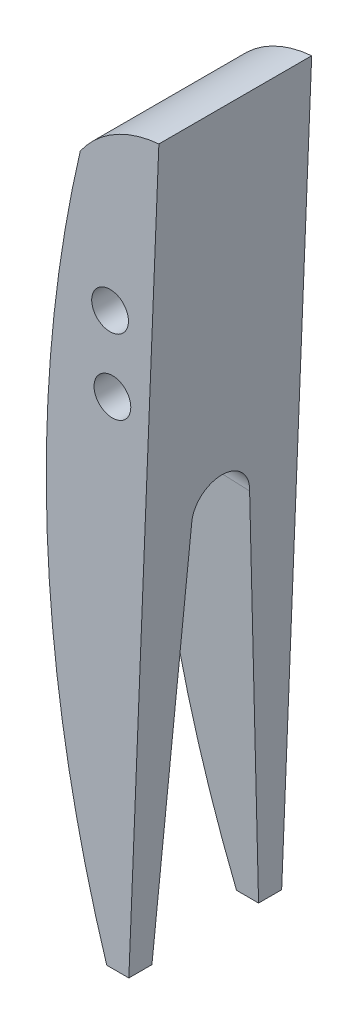
ISO-10303-21;
HEADER;
FILE_DESCRIPTION(('STEP AP214'),'2;1');
FILE_NAME('part.step','',(''),(''),'','','');
FILE_SCHEMA(('AUTOMOTIVE_DESIGN { 1 0 10303 214 1 1 1 1 }'));
ENDSEC;
DATA;
#1=APPLICATION_CONTEXT('core data for automotive mechanical design processes');
#2=APPLICATION_PROTOCOL_DEFINITION('international standard','automotive_design',2000,#1);
#3=PRODUCT_CONTEXT('',#1,'mechanical');
#4=PRODUCT('Part','Part','',(#3));
#5=PRODUCT_RELATED_PRODUCT_CATEGORY('part','',(#4));
#6=PRODUCT_DEFINITION_FORMATION('','',#4);
#7=PRODUCT_DEFINITION_CONTEXT('part definition',#1,'design');
#8=PRODUCT_DEFINITION('design','',#6,#7);
#9=PRODUCT_DEFINITION_SHAPE('','',#8);
#10=(LENGTH_UNIT() NAMED_UNIT(*) SI_UNIT(.MILLI.,.METRE.));
#11=(NAMED_UNIT(*) PLANE_ANGLE_UNIT() SI_UNIT($,.RADIAN.));
#12=(NAMED_UNIT(*) SI_UNIT($,.STERADIAN.) SOLID_ANGLE_UNIT());
#13=UNCERTAINTY_MEASURE_WITH_UNIT(LENGTH_MEASURE(1.E-05),#10,'distance_accuracy_value','');
#14=(GEOMETRIC_REPRESENTATION_CONTEXT(3) GLOBAL_UNCERTAINTY_ASSIGNED_CONTEXT((#13)) GLOBAL_UNIT_ASSIGNED_CONTEXT((#10,
#11,#12)) REPRESENTATION_CONTEXT('',''));
#15=CARTESIAN_POINT('',(0.,0.,0.));
#16=DIRECTION('',(0.,0.,1.));
#17=DIRECTION('',(1.,0.,0.));
#18=AXIS2_PLACEMENT_3D('',#15,#16,#17);
#19=CARTESIAN_POINT('',(74.7353828290248,81.7864220973109,10.033));
#20=DIRECTION('',(0.,0.,1.));
#21=DIRECTION('',(1.,0.,0.));
#22=AXIS2_PLACEMENT_3D('',#19,#20,#21);
#23=PLANE('',#22);
#24=DIRECTION('',(-1.,0.,0.));
#25=VECTOR('',#24,1.);
#26=CARTESIAN_POINT('',(70.7043807606594,40.3898056532261,10.033));
#27=LINE('',#26,#25);
#28=CARTESIAN_POINT('',(72.15587101361,40.3898056532261,10.033));
#29=VERTEX_POINT('',#28);
#30=CARTESIAN_POINT('',(70.7043807606594,40.3898056532261,10.033));
#31=VERTEX_POINT('',#30);
#32=EDGE_CURVE('E100',#29,#31,#27,.T.);
#33=ORIENTED_EDGE('',*,*,#32,.F.);
#34=DIRECTION('',(0.040704362984607,0.999171233990459,0.));
#35=VECTOR('',#34,1.);
#36=CARTESIAN_POINT('',(74.1278462983194,88.7959428372659,10.033));
#37=LINE('',#36,#35);
#38=CARTESIAN_POINT('',(74.1278462983194,88.7959428372659,10.033));
#39=VERTEX_POINT('',#38);
#40=EDGE_CURVE('E111',#29,#39,#37,.T.);
#41=ORIENTED_EDGE('',*,*,#40,.T.);
#42=CARTESIAN_POINT('',(74.7353828290248,81.7864220973109,10.033));
#43=DIRECTION('',(0.,0.,1.));
#44=DIRECTION('',(1.,0.,0.));
#45=AXIS2_PLACEMENT_3D('',#42,#43,#44);
#46=CIRCLE('',#45,7.03580000000001);
#47=CARTESIAN_POINT('',(68.9663347270801,85.8138984333617,10.033));
#48=VERTEX_POINT('',#47);
#49=EDGE_CURVE('E121',#39,#48,#46,.T.);
#50=ORIENTED_EDGE('',*,*,#49,.T.);
#51=CARTESIAN_POINT('',(153.221382829025,66.292422097311,10.033));
#52=DIRECTION('',(0.,0.,1.));
#53=DIRECTION('',(1.,0.,0.));
#54=AXIS2_PLACEMENT_3D('',#51,#52,#53);
#55=CIRCLE('',#54,86.487);
#56=EDGE_CURVE('E113',#48,#31,#55,.T.);
#57=ORIENTED_EDGE('',*,*,#56,.T.);
#58=EDGE_LOOP('',(#33,#41,#50,#57));
#59=FACE_BOUND('',#58,.T.);
#60=CARTESIAN_POINT('',(70.9253828290248,77.722422097311,10.033));
#61=DIRECTION('',(0.,0.,1.));
#62=DIRECTION('',(1.,0.,0.));
#63=AXIS2_PLACEMENT_3D('',#60,#61,#62);
#64=CIRCLE('',#63,1.2065);
#65=CARTESIAN_POINT('',(72.1318828290248,77.722422097311,10.033));
#66=VERTEX_POINT('',#65);
#67=EDGE_CURVE('E129',#66,#66,#64,.T.);
#68=ORIENTED_EDGE('',*,*,#67,.F.);
#69=EDGE_LOOP('',(#68));
#70=FACE_BOUND('',#69,.T.);
#71=CARTESIAN_POINT('',(71.0777828290248,72.896422097311,10.033));
#72=DIRECTION('',(0.,0.,1.));
#73=DIRECTION('',(1.,0.,0.));
#74=AXIS2_PLACEMENT_3D('',#71,#72,#73);
#75=CIRCLE('',#74,1.2065);
#76=CARTESIAN_POINT('',(72.2842828290248,72.896422097311,10.033));
#77=VERTEX_POINT('',#76);
#78=EDGE_CURVE('E289',#77,#77,#75,.T.);
#79=ORIENTED_EDGE('',*,*,#78,.F.);
#80=EDGE_LOOP('',(#79));
#81=FACE_BOUND('',#80,.T.);
#82=ADVANCED_FACE('F35',(#59,#70,#81),#23,.T.);
#83=CARTESIAN_POINT('',(74.7353828290248,81.7864220973109,0.));
#84=DIRECTION('',(0.,0.,1.));
#85=DIRECTION('',(1.,0.,0.));
#86=AXIS2_PLACEMENT_3D('',#83,#84,#85);
#87=PLANE('',#86);
#88=DIRECTION('',(0.040704362984607,0.999171233990459,0.));
#89=VECTOR('',#88,1.);
#90=CARTESIAN_POINT('',(74.1278462983194,88.7959428372659,0.));
#91=LINE('',#90,#89);
#92=CARTESIAN_POINT('',(72.15587101361,40.3898056532261,0.));
#93=VERTEX_POINT('',#92);
#94=CARTESIAN_POINT('',(74.1278462983194,88.7959428372659,0.));
#95=VERTEX_POINT('',#94);
#96=EDGE_CURVE('E132',#93,#95,#91,.T.);
#97=ORIENTED_EDGE('',*,*,#96,.F.);
#98=DIRECTION('',(1.,0.,0.));
#99=VECTOR('',#98,1.);
#100=CARTESIAN_POINT('',(70.7043807606594,40.3898056532261,0.));
#101=LINE('',#100,#99);
#102=CARTESIAN_POINT('',(70.7043807606594,40.3898056532261,0.));
#103=VERTEX_POINT('',#102);
#104=EDGE_CURVE('E145',#103,#93,#101,.T.);
#105=ORIENTED_EDGE('',*,*,#104,.F.);
#106=CARTESIAN_POINT('',(153.221382829025,66.292422097311,0.));
#107=DIRECTION('',(0.,0.,1.));
#108=DIRECTION('',(1.,0.,0.));
#109=AXIS2_PLACEMENT_3D('',#106,#107,#108);
#110=CIRCLE('',#109,86.487);
#111=CARTESIAN_POINT('',(68.9663347270801,85.8138984333617,0.));
#112=VERTEX_POINT('',#111);
#113=EDGE_CURVE('E128',#112,#103,#110,.T.);
#114=ORIENTED_EDGE('',*,*,#113,.F.);
#115=CARTESIAN_POINT('',(74.7353828290248,81.7864220973109,0.));
#116=DIRECTION('',(0.,0.,1.));
#117=DIRECTION('',(1.,0.,0.));
#118=AXIS2_PLACEMENT_3D('',#115,#116,#117);
#119=CIRCLE('',#118,7.03580000000001);
#120=EDGE_CURVE('E125',#95,#112,#119,.T.);
#121=ORIENTED_EDGE('',*,*,#120,.F.);
#122=EDGE_LOOP('',(#97,#105,#114,#121));
#123=FACE_BOUND('',#122,.T.);
#124=CARTESIAN_POINT('',(70.9253828290248,77.722422097311,0.));
#125=DIRECTION('',(0.,0.,1.));
#126=DIRECTION('',(1.,0.,0.));
#127=AXIS2_PLACEMENT_3D('',#124,#125,#126);
#128=CIRCLE('',#127,1.2065);
#129=CARTESIAN_POINT('',(72.1318828290248,77.722422097311,0.));
#130=VERTEX_POINT('',#129);
#131=EDGE_CURVE('E294',#130,#130,#128,.T.);
#132=ORIENTED_EDGE('',*,*,#131,.T.);
#133=EDGE_LOOP('',(#132));
#134=FACE_BOUND('',#133,.T.);
#135=CARTESIAN_POINT('',(71.0777828290248,72.896422097311,0.));
#136=DIRECTION('',(0.,0.,1.));
#137=DIRECTION('',(1.,0.,0.));
#138=AXIS2_PLACEMENT_3D('',#135,#136,#137);
#139=CIRCLE('',#138,1.2065);
#140=CARTESIAN_POINT('',(72.2842828290248,72.896422097311,0.));
#141=VERTEX_POINT('',#140);
#142=EDGE_CURVE('E287',#141,#141,#139,.T.);
#143=ORIENTED_EDGE('',*,*,#142,.T.);
#144=EDGE_LOOP('',(#143));
#145=FACE_BOUND('',#144,.T.);
#146=ADVANCED_FACE('F142',(#123,#134,#145),#87,.F.);
#147=CARTESIAN_POINT('',(74.7353828290248,81.7864220973109,10.033));
#148=DIRECTION('',(0.,0.,-1.));
#149=DIRECTION('',(-1.,0.,0.));
#150=AXIS2_PLACEMENT_3D('',#147,#148,#149);
#151=CYLINDRICAL_SURFACE('',#150,7.03580000000001);
#152=ORIENTED_EDGE('',*,*,#120,.T.);
#153=DIRECTION('',(0.,0.,-1.));
#154=VECTOR('',#153,1.);
#155=CARTESIAN_POINT('',(68.9663347270801,85.8138984333617,10.033));
#156=LINE('',#155,#154);
#157=EDGE_CURVE('E43',#48,#112,#156,.T.);
#158=ORIENTED_EDGE('',*,*,#157,.F.);
#159=ORIENTED_EDGE('',*,*,#49,.F.);
#160=DIRECTION('',(0.,0.,-1.));
#161=VECTOR('',#160,1.);
#162=CARTESIAN_POINT('',(74.1278462983194,88.7959428372659,10.033));
#163=LINE('',#162,#161);
#164=EDGE_CURVE('E117',#39,#95,#163,.T.);
#165=ORIENTED_EDGE('',*,*,#164,.T.);
#166=EDGE_LOOP('',(#152,#158,#159,#165));
#167=FACE_BOUND('',#166,.T.);
#168=ADVANCED_FACE('F37',(#167),#151,.T.);
#169=CARTESIAN_POINT('',(153.221382829025,66.292422097311,10.033));
#170=DIRECTION('',(0.,0.,-1.));
#171=DIRECTION('',(-1.,0.,0.));
#172=AXIS2_PLACEMENT_3D('',#169,#170,#171);
#173=CYLINDRICAL_SURFACE('',#172,86.487);
#174=ORIENTED_EDGE('',*,*,#113,.T.);
#175=DIRECTION('',(0.,0.,1.));
#176=VECTOR('',#175,1.);
#177=CARTESIAN_POINT('',(70.7043807606594,40.3898056532261,-4.08215330838494));
#178=LINE('',#177,#176);
#179=CARTESIAN_POINT('',(70.7043807606594,40.3898056532261,1.51227671406782));
#180=VERTEX_POINT('',#179);
#181=EDGE_CURVE('E146',#103,#180,#178,.T.);
#182=ORIENTED_EDGE('',*,*,#181,.T.);
#183=CARTESIAN_POINT('',(153.221382829025,66.292422097311,3.39662912735156));
#184=DIRECTION('',(0.0026177398413144,0.0642577393607959,-0.997929902533421));
#185=DIRECTION('',(-0.0406201009859138,-0.997102852150297,-0.0643110381632639));
#186=AXIS2_PLACEMENT_3D('',#183,#184,#185);
#187=ELLIPSE('',#186,86.666407911455,86.487);
#188=CARTESIAN_POINT('',(66.7391175209196,65.3874601210305,3.11149999999997));
#189=VERTEX_POINT('',#188);
#190=EDGE_CURVE('E161',#180,#189,#187,.T.);
#191=ORIENTED_EDGE('',*,*,#190,.T.);
#192=CARTESIAN_POINT('',(66.7391175209196,65.3874601210305,3.11149999999997));
#193=CARTESIAN_POINT('',(66.7385556558944,65.4411278103967,3.11150038620164));
#194=CARTESIAN_POINT('',(66.7380446370746,65.4947704289813,3.11376362614224));
#195=CARTESIAN_POINT('',(66.7371248030678,65.6016737523277,3.1227941187202));
#196=CARTESIAN_POINT('',(66.7367159836392,65.6549344728505,3.12956118438911));
#197=CARTESIAN_POINT('',(66.7356446393563,65.8134883275784,3.15655784723912));
#198=CARTESIAN_POINT('',(66.7351354785727,65.9177221058591,3.18348306749004));
#199=CARTESIAN_POINT('',(66.7344948661265,66.1201889091231,3.25445349755626));
#200=CARTESIAN_POINT('',(66.7343636015566,66.2184189381641,3.29850717525166));
#201=CARTESIAN_POINT('',(66.7344066006435,66.4060749597693,3.40248606617196));
#202=CARTESIAN_POINT('',(66.7345807992412,66.4955028227813,3.46240789740546));
#203=CARTESIAN_POINT('',(66.7351359263829,66.6629431487419,3.59637466553797));
#204=CARTESIAN_POINT('',(66.7355166883609,66.740964745073,3.67040819206251));
#205=CARTESIAN_POINT('',(66.7363730389729,66.883473488676,3.83054302090883));
#206=CARTESIAN_POINT('',(66.7368486420575,66.9479585703625,3.91664616163807));
#207=CARTESIAN_POINT('',(66.7377836672712,67.0614984985323,4.098396039838));
#208=CARTESIAN_POINT('',(66.7382431013325,67.1105649447823,4.19403553120485));
#209=CARTESIAN_POINT('',(66.7390510654862,67.1919369090083,4.39219031680982));
#210=CARTESIAN_POINT('',(66.7393996029632,67.2242435430946,4.4947051526747));
#211=CARTESIAN_POINT('',(66.7399179654658,67.2711767285449,4.7036774655834));
#212=CARTESIAN_POINT('',(66.7400878368037,67.2858078617375,4.81013391350823));
#213=CARTESIAN_POINT('',(66.7402169909001,67.2969901683433,5.02399477562736));
#214=CARTESIAN_POINT('',(66.7401762689048,67.2935409336301,5.13139921116586));
#215=CARTESIAN_POINT('',(66.7398918657832,67.2686604474035,5.34409578121339));
#216=CARTESIAN_POINT('',(66.7396482006591,67.2472306136678,5.4493880815949));
#217=CARTESIAN_POINT('',(66.739004275444,67.1869992077408,5.65487995867905));
#218=CARTESIAN_POINT('',(66.7386040159197,67.1481976983944,5.7550795538039));
#219=CARTESIAN_POINT('',(66.7377261678881,67.0543224012855,5.94754784231817));
#220=CARTESIAN_POINT('',(66.7372485753036,66.9992477554156,6.03981611714553));
#221=CARTESIAN_POINT('',(66.736318447865,66.8743941841238,6.21379405832366));
#222=CARTESIAN_POINT('',(66.7358659117865,66.8046159780215,6.29550424087616));
#223=CARTESIAN_POINT('',(66.7350982703756,66.6523349676086,6.44605914072651));
#224=CARTESIAN_POINT('',(66.7347831707158,66.5698316382595,6.51490332691398));
#225=CARTESIAN_POINT('',(66.7343985728257,66.3944117668896,6.63779500259123));
#226=CARTESIAN_POINT('',(66.7343291524078,66.3014919353223,6.69183779912371));
#227=CARTESIAN_POINT('',(66.7345255733129,66.1078165454996,6.78362466673437));
#228=CARTESIAN_POINT('',(66.7347917914747,66.0070522991687,6.82135035383468));
#229=CARTESIAN_POINT('',(66.7357194120165,65.8007043529685,6.87931447201896));
#230=CARTESIAN_POINT('',(66.7363802153059,65.6951281829413,6.89957929985357));
#231=CARTESIAN_POINT('',(66.7375176581982,65.5552861432379,6.91441047662789));
#232=CARTESIAN_POINT('',(66.7378100459612,65.5217461293835,6.91707054661055));
#233=CARTESIAN_POINT('',(66.7384342794623,65.4546285715774,6.9206128792976));
#234=CARTESIAN_POINT('',(66.7387660588078,65.4210511826678,6.92149808962336));
#235=CARTESIAN_POINT('',(66.7391175209196,65.3874601210305,6.92149999999997));
#236=B_SPLINE_CURVE_WITH_KNOTS('',3,(#192,#193,#194,#195,#196,#197,#198,#199,#200,#201,#202,
#203,#204,#205,#206,#207,#208,#209,#210,#211,#212,#213,#214,#215,#216,#217,#218,#219,#220,#221,
#222,#223,#224,#225,#226,#227,#228,#229,#230,#231,#232,#233,#234,#235),.UNSPECIFIED.,.F.,.F.,(4,
2,2,2,2,2,2,2,2,2,2,2,2,2,2,2,2,2,2,2,2,4),(0.,0.160913242079847,0.321819804544366,
0.643132494662066,0.964604236114471,1.28600751712147,1.60715201325538,1.92834547841615,
2.24929672117468,2.57022658762346,2.89107324503801,3.21192714492536,3.53275574773111,
3.85358318989816,4.17442755281119,4.49525622319847,4.81609813452017,5.13704165514474,
5.45834583681588,5.77916342488324,5.88007042026583,5.98080969376572),.UNSPECIFIED.);
#237=CARTESIAN_POINT('',(66.7391175209196,65.3874601210305,6.92149999999997));
#238=VERTEX_POINT('',#237);
#239=EDGE_CURVE('E165',#189,#238,#236,.T.);
#240=ORIENTED_EDGE('',*,*,#239,.T.);
#241=CARTESIAN_POINT('',(153.221382829025,66.292422097311,6.63637087264837));
#242=DIRECTION('',(0.00261773984131449,0.064257739360798,0.997929902533421));
#243=DIRECTION('',(0.0406201009859138,0.997102852150297,-0.0643110381632659));
#244=AXIS2_PLACEMENT_3D('',#241,#242,#243);
#245=ELLIPSE('',#244,86.666407911455,86.487);
#246=CARTESIAN_POINT('',(70.7043807606594,40.3898056532261,8.52072328593217));
#247=VERTEX_POINT('',#246);
#248=EDGE_CURVE('E173',#238,#247,#245,.T.);
#249=ORIENTED_EDGE('',*,*,#248,.T.);
#250=EDGE_CURVE('E50',#247,#31,#178,.T.);
#251=ORIENTED_EDGE('',*,*,#250,.T.);
#252=ORIENTED_EDGE('',*,*,#56,.F.);
#253=ORIENTED_EDGE('',*,*,#157,.T.);
#254=EDGE_LOOP('',(#174,#182,#191,#240,#249,#251,#252,#253));
#255=FACE_BOUND('',#254,.T.);
#256=ADVANCED_FACE('F136',(#255),#173,.T.);
#257=CARTESIAN_POINT('',(74.1278462983194,88.7959428372659,10.033));
#258=DIRECTION('',(-0.999171233990459,0.040704362984607,0.));
#259=DIRECTION('',(-0.040704362984607,-0.999171233990459,0.));
#260=AXIS2_PLACEMENT_3D('',#257,#258,#259);
#261=PLANE('',#260);
#262=ORIENTED_EDGE('',*,*,#40,.F.);
#263=DIRECTION('',(0.,0.,1.));
#264=VECTOR('',#263,1.);
#265=CARTESIAN_POINT('',(72.15587101361,40.3898056532261,-4.08215330838494));
#266=LINE('',#265,#264);
#267=CARTESIAN_POINT('',(72.15587101361,40.3898056532261,8.51691578015969));
#268=VERTEX_POINT('',#267);
#269=EDGE_CURVE('E97',#268,#29,#266,.T.);
#270=ORIENTED_EDGE('',*,*,#269,.F.);
#271=DIRECTION('',(-0.0406201009859138,-0.997102852150297,0.0643110381632659));
#272=VECTOR('',#271,1.);
#273=CARTESIAN_POINT('',(72.0004394400195,36.574422097311,8.763));
#274=LINE('',#273,#272);
#275=CARTESIAN_POINT('',(73.1635666123046,65.1257401085883,6.92149999999997));
#276=VERTEX_POINT('',#275);
#277=EDGE_CURVE('E148',#276,#268,#274,.T.);
#278=ORIENTED_EDGE('',*,*,#277,.F.);
#279=CARTESIAN_POINT('',(73.1635666123046,65.1257401085883,5.01649999999997));
#280=DIRECTION('',(0.999171233990459,-0.040704362984607,0.));
#281=DIRECTION('',(0.040704362984607,0.999171233990459,0.));
#282=AXIS2_PLACEMENT_3D('',#279,#280,#281);
#283=CIRCLE('',#282,1.905);
#284=CARTESIAN_POINT('',(73.1635666123046,65.1257401085883,3.11149999999997));
#285=VERTEX_POINT('',#284);
#286=EDGE_CURVE('E155',#285,#276,#283,.T.);
#287=ORIENTED_EDGE('',*,*,#286,.F.);
#288=DIRECTION('',(0.0406201009859138,0.997102852150297,0.0643110381632639));
#289=VECTOR('',#288,1.);
#290=CARTESIAN_POINT('',(72.0004394400195,36.574422097311,1.27));
#291=LINE('',#290,#289);
#292=CARTESIAN_POINT('',(72.15587101361,40.3898056532261,1.5160842198403));
#293=VERTEX_POINT('',#292);
#294=EDGE_CURVE('E153',#293,#285,#291,.T.);
#295=ORIENTED_EDGE('',*,*,#294,.F.);
#296=EDGE_CURVE('E58',#93,#293,#266,.T.);
#297=ORIENTED_EDGE('',*,*,#296,.F.);
#298=ORIENTED_EDGE('',*,*,#96,.T.);
#299=ORIENTED_EDGE('',*,*,#164,.F.);
#300=EDGE_LOOP('',(#262,#270,#278,#287,#295,#297,#298,#299));
#301=FACE_BOUND('',#300,.T.);
#302=ADVANCED_FACE('F115',(#301),#261,.F.);
#303=CARTESIAN_POINT('',(70.9253828290248,77.722422097311,10.033));
#304=DIRECTION('',(0.,0.,-1.));
#305=DIRECTION('',(-1.,0.,0.));
#306=AXIS2_PLACEMENT_3D('',#303,#304,#305);
#307=CYLINDRICAL_SURFACE('',#306,1.2065);
#308=ORIENTED_EDGE('',*,*,#67,.T.);
#309=EDGE_LOOP('',(#308));
#310=FACE_BOUND('',#309,.T.);
#311=ORIENTED_EDGE('',*,*,#131,.F.);
#312=EDGE_LOOP('',(#311));
#313=FACE_BOUND('',#312,.T.);
#314=ADVANCED_FACE('F195',(#310,#313),#307,.F.);
#315=CARTESIAN_POINT('',(71.0777828290248,72.896422097311,10.033));
#316=DIRECTION('',(0.,0.,-1.));
#317=DIRECTION('',(-1.,0.,0.));
#318=AXIS2_PLACEMENT_3D('',#315,#316,#317);
#319=CYLINDRICAL_SURFACE('',#318,1.2065);
#320=ORIENTED_EDGE('',*,*,#78,.T.);
#321=EDGE_LOOP('',(#320));
#322=FACE_BOUND('',#321,.T.);
#323=ORIENTED_EDGE('',*,*,#142,.F.);
#324=EDGE_LOOP('',(#323));
#325=FACE_BOUND('',#324,.T.);
#326=ADVANCED_FACE('F191',(#322,#325),#319,.F.);
#327=CARTESIAN_POINT('',(61.9757544493932,36.9828089711355,8.763));
#328=DIRECTION('',(0.00261773984131449,0.064257739360798,0.997929902533421));
#329=DIRECTION('',(0.,-0.997933321739197,0.064257959526997));
#330=AXIS2_PLACEMENT_3D('',#327,#328,#329);
#331=PLANE('',#330);
#332=ORIENTED_EDGE('',*,*,#277,.T.);
#333=DIRECTION('',(-0.999996559507176,0.,0.00262316103401028));
#334=VECTOR('',#333,1.);
#335=CARTESIAN_POINT('',(61.975178982193,40.3898056532261,8.54362146667648));
#336=LINE('',#335,#334);
#337=EDGE_CURVE('E101',#268,#247,#336,.T.);
#338=ORIENTED_EDGE('',*,*,#337,.T.);
#339=ORIENTED_EDGE('',*,*,#248,.F.);
#340=DIRECTION('',(0.999171233990459,-0.040704362984607,0.));
#341=VECTOR('',#340,1.);
#342=CARTESIAN_POINT('',(63.1388816216784,65.5341269824129,6.92149999999997));
#343=LINE('',#342,#341);
#344=EDGE_CURVE('E159',#238,#276,#343,.T.);
#345=ORIENTED_EDGE('',*,*,#344,.T.);
#346=EDGE_LOOP('',(#332,#338,#339,#345));
#347=FACE_BOUND('',#346,.T.);
#348=ADVANCED_FACE('F183',(#347),#331,.F.);
#349=CARTESIAN_POINT('',(63.1388816216784,65.5341269824129,5.01649999999997));
#350=DIRECTION('',(0.999171233990459,-0.040704362984607,0.));
#351=DIRECTION('',(0.040704362984607,0.999171233990459,0.));
#352=AXIS2_PLACEMENT_3D('',#349,#350,#351);
#353=CYLINDRICAL_SURFACE('',#352,1.905);
#354=DIRECTION('',(0.999171233990459,-0.040704362984607,0.));
#355=VECTOR('',#354,1.);
#356=CARTESIAN_POINT('',(63.1388816216784,65.5341269824129,3.11149999999997));
#357=LINE('',#356,#355);
#358=EDGE_CURVE('E158',#189,#285,#357,.T.);
#359=ORIENTED_EDGE('',*,*,#358,.T.);
#360=ORIENTED_EDGE('',*,*,#286,.T.);
#361=ORIENTED_EDGE('',*,*,#344,.F.);
#362=ORIENTED_EDGE('',*,*,#239,.F.);
#363=EDGE_LOOP('',(#359,#360,#361,#362));
#364=FACE_BOUND('',#363,.T.);
#365=ADVANCED_FACE('F177',(#364),#353,.F.);
#366=CARTESIAN_POINT('',(61.9757544493932,36.9828089711355,1.27));
#367=DIRECTION('',(0.0026177398413144,0.0642577393607959,-0.997929902533421));
#368=DIRECTION('',(0.,0.997933321739197,0.0642579595269949));
#369=AXIS2_PLACEMENT_3D('',#366,#367,#368);
#370=PLANE('',#369);
#371=ORIENTED_EDGE('',*,*,#190,.F.);
#372=DIRECTION('',(0.999996559507176,0.,0.0026231610340102));
#373=VECTOR('',#372,1.);
#374=CARTESIAN_POINT('',(61.975178982193,40.3898056532261,1.48937853332351));
#375=LINE('',#374,#373);
#376=EDGE_CURVE('E11',#180,#293,#375,.T.);
#377=ORIENTED_EDGE('',*,*,#376,.T.);
#378=ORIENTED_EDGE('',*,*,#294,.T.);
#379=ORIENTED_EDGE('',*,*,#358,.F.);
#380=EDGE_LOOP('',(#371,#377,#378,#379));
#381=FACE_BOUND('',#380,.T.);
#382=ADVANCED_FACE('F182',(#381),#370,.F.);
#383=CARTESIAN_POINT('',(70.7043807606594,40.3898056532261,-4.08215330838494));
#384=DIRECTION('',(0.,1.,0.));
#385=DIRECTION('',(0.,0.,1.));
#386=AXIS2_PLACEMENT_3D('',#383,#384,#385);
#387=PLANE('',#386);
#388=ORIENTED_EDGE('',*,*,#181,.F.);
#389=ORIENTED_EDGE('',*,*,#104,.T.);
#390=ORIENTED_EDGE('',*,*,#296,.T.);
#391=ORIENTED_EDGE('',*,*,#376,.F.);
#392=EDGE_LOOP('',(#388,#389,#390,#391));
#393=FACE_BOUND('',#392,.T.);
#394=ADVANCED_FACE('F187',(#393),#387,.F.);
#395=ORIENTED_EDGE('',*,*,#269,.T.);
#396=ORIENTED_EDGE('',*,*,#32,.T.);
#397=ORIENTED_EDGE('',*,*,#250,.F.);
#398=ORIENTED_EDGE('',*,*,#337,.F.);
#399=EDGE_LOOP('',(#395,#396,#397,#398));
#400=FACE_BOUND('',#399,.T.);
#401=ADVANCED_FACE('F99',(#400),#387,.F.);
#402=CLOSED_SHELL('',(#82,#146,#168,#256,#302,#314,#326,#348,#365,#382,#394,#401));
#403=MANIFOLD_SOLID_BREP('B2',#402);
#404=ADVANCED_BREP_SHAPE_REPRESENTATION('',(#18,#403),#14);
#405=SHAPE_DEFINITION_REPRESENTATION(#9,#404);
ENDSEC;
END-ISO-10303-21;
